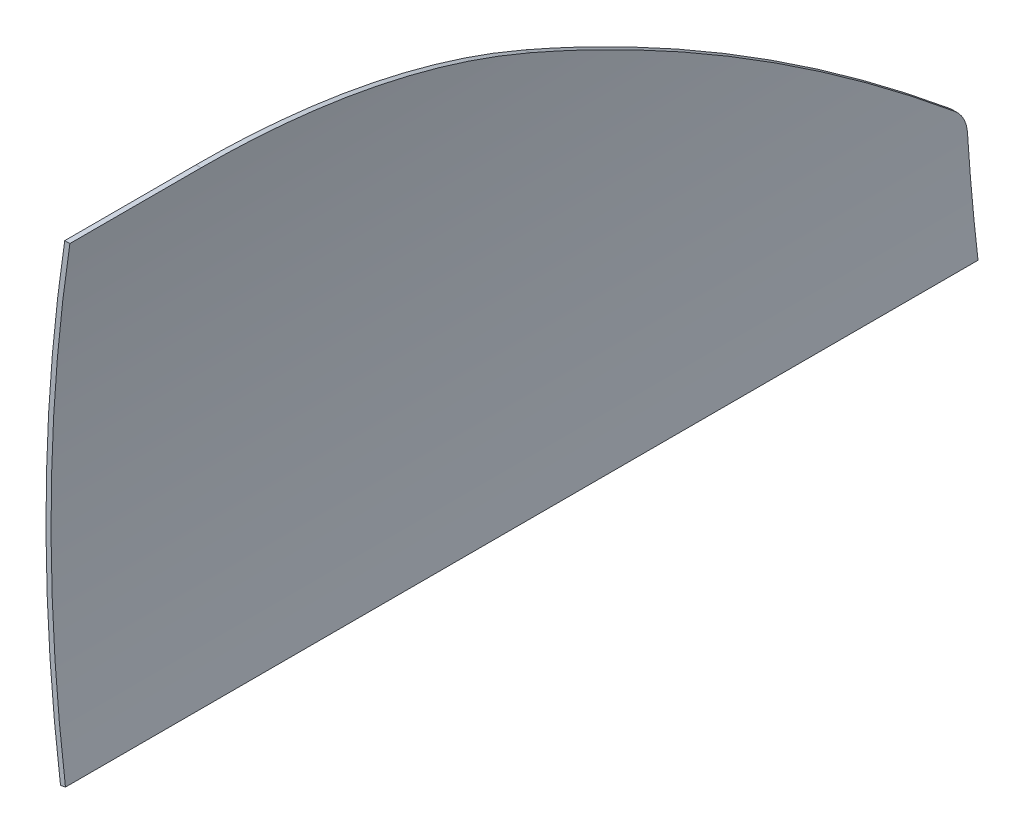
ISO-10303-21;
HEADER;
FILE_DESCRIPTION(('STEP AP214'),'2;1');
FILE_NAME('part.step','',(''),(''),'','','');
FILE_SCHEMA(('AUTOMOTIVE_DESIGN { 1 0 10303 214 1 1 1 1 }'));
ENDSEC;
DATA;
#1=APPLICATION_CONTEXT('core data for automotive mechanical design processes');
#2=APPLICATION_PROTOCOL_DEFINITION('international standard','automotive_design',2000,#1);
#3=PRODUCT_CONTEXT('',#1,'mechanical');
#4=PRODUCT('Part','Part','',(#3));
#5=PRODUCT_RELATED_PRODUCT_CATEGORY('part','',(#4));
#6=PRODUCT_DEFINITION_FORMATION('','',#4);
#7=PRODUCT_DEFINITION_CONTEXT('part definition',#1,'design');
#8=PRODUCT_DEFINITION('design','',#6,#7);
#9=PRODUCT_DEFINITION_SHAPE('','',#8);
#10=(LENGTH_UNIT() NAMED_UNIT(*) SI_UNIT(.MILLI.,.METRE.));
#11=(NAMED_UNIT(*) PLANE_ANGLE_UNIT() SI_UNIT($,.RADIAN.));
#12=(NAMED_UNIT(*) SI_UNIT($,.STERADIAN.) SOLID_ANGLE_UNIT());
#13=UNCERTAINTY_MEASURE_WITH_UNIT(LENGTH_MEASURE(1.E-05),#10,'distance_accuracy_value','');
#14=(GEOMETRIC_REPRESENTATION_CONTEXT(3) GLOBAL_UNCERTAINTY_ASSIGNED_CONTEXT((#13)) GLOBAL_UNIT_ASSIGNED_CONTEXT((#10,
#11,#12)) REPRESENTATION_CONTEXT('',''));
#15=CARTESIAN_POINT('',(0.,0.,0.));
#16=DIRECTION('',(0.,0.,1.));
#17=DIRECTION('',(1.,0.,0.));
#18=AXIS2_PLACEMENT_3D('',#15,#16,#17);
#19=CARTESIAN_POINT('',(1662.91267359414,250.,308.));
#20=DIRECTION('',(0.,0.,1.));
#21=DIRECTION('',(-1.,0.,0.));
#22=AXIS2_PLACEMENT_3D('',#19,#20,#21);
#23=CYLINDRICAL_SURFACE('',#22,1679.1);
#24=CARTESIAN_POINT('',(1662.91267359414,250.,404.));
#25=DIRECTION('',(0.,0.,1.));
#26=DIRECTION('',(1.,0.,0.));
#27=AXIS2_PLACEMENT_3D('',#24,#25,#26);
#28=CIRCLE('',#27,1679.1);
#29=CARTESIAN_POINT('',(-1.85821629717053,31.1057466023691,404.));
#30=VERTEX_POINT('',#29);
#31=CARTESIAN_POINT('',(-12.2574940213667,135.188330161751,404.));
#32=VERTEX_POINT('',#31);
#33=EDGE_CURVE('E126',#30,#32,#28,.F.);
#34=ORIENTED_EDGE('',*,*,#33,.T.);
#35=CARTESIAN_POINT('',(-12.2574940213667,135.188330161751,404.));
#36=CARTESIAN_POINT('',(-12.2864303509859,135.610524856966,403.999999538775));
#37=CARTESIAN_POINT('',(-12.3152033484983,136.032683792228,404.008913477108));
#38=CARTESIAN_POINT('',(-12.3723795026291,136.876264779503,404.044547705152));
#39=CARTESIAN_POINT('',(-12.4007826677193,137.297686848203,404.071267586249));
#40=CARTESIAN_POINT('',(-12.4853616680688,138.559685367766,404.178086712017));
#41=CARTESIAN_POINT('',(-12.5409203534523,139.398188875581,404.28484546129));
#42=CARTESIAN_POINT('',(-12.6499925060041,141.063056240984,404.568716356648));
#43=CARTESIAN_POINT('',(-12.7035066300835,141.88942394433,404.745805693771));
#44=CARTESIAN_POINT('',(-12.7820081314885,143.115428253876,405.063181768486));
#45=CARTESIAN_POINT('',(-12.8078810880648,143.521850268377,405.177601608815));
#46=CARTESIAN_POINT('',(-12.8590142278855,144.329644118176,405.423529286639));
#47=CARTESIAN_POINT('',(-12.8842742524691,144.731014633194,405.55504149375));
#48=CARTESIAN_POINT('',(-12.9591045688719,145.926800879809,405.975026753511));
#49=CARTESIAN_POINT('',(-13.0077016081075,146.712524044109,406.288853342524));
#50=CARTESIAN_POINT('',(-13.1020404921137,148.254802470497,406.981820549094));
#51=CARTESIAN_POINT('',(-13.1477823222455,149.011357583031,407.360961501482));
#52=CARTESIAN_POINT('',(-13.214080157634,150.119809342587,407.976366585649));
#53=CARTESIAN_POINT('',(-13.2357877410823,150.484795843403,408.189216356547));
#54=CARTESIAN_POINT('',(-13.278414448833,151.205381719958,408.630087692131));
#55=CARTESIAN_POINT('',(-13.2993337916973,151.560983689508,408.858105001969));
#56=CARTESIAN_POINT('',(-13.3608843173413,152.61282487253,409.56437490661));
#57=CARTESIAN_POINT('',(-13.4003237306305,153.294362851921,410.064991794749));
#58=CARTESIAN_POINT('',(-13.4615129469372,154.362325531576,410.92115984097));
#59=CARTESIAN_POINT('',(-13.4842945370347,154.762566032009,411.259638658816));
#60=CARTESIAN_POINT('',(-13.5285512291079,155.544809266365,411.957127853397));
#61=CARTESIAN_POINT('',(-13.5500264614183,155.926813818856,412.316136174958));
#62=CARTESIAN_POINT('',(-13.5916281455417,156.671145444289,413.053335841709));
#63=CARTESIAN_POINT('',(-13.6117559204717,157.033491752044,413.431507708688));
#64=CARTESIAN_POINT('',(-13.6506747354486,157.738016724901,414.206412841287));
#65=CARTESIAN_POINT('',(-13.6694654753302,158.080190858401,414.603150241946));
#66=CARTESIAN_POINT('',(-13.6875775153225,158.411747589012,415.008610293105));
#67=B_SPLINE_CURVE_WITH_KNOTS('',3,(#35,#36,#37,#38,#39,#40,#41,#42,#43,#44,#45,#46,#47,#48,#49,
#50,#51,#52,#53,#54,#55,#56,#57,#58,#59,#60,#61,#62,#63,#64,#65,#66),.UNSPECIFIED.,.F.,.F.,(4,2,
2,2,2,2,2,2,2,2,2,2,2,2,2,4),(0.,1.26936796567069,2.53870680251005,5.07680077410025,
7.61407228599208,8.88278287242378,10.1518184415712,12.691026200315,15.2302469765906,
16.4991318934745,17.7676623476523,20.3038206508079,21.8772282234228,23.4504785596796,
25.0221606911958,26.5941945601457),.UNSPECIFIED.);
#68=CARTESIAN_POINT('',(-13.6875775153225,158.411747589012,415.008610293105));
#69=VERTEX_POINT('',#68);
#70=EDGE_CURVE('E128',#32,#69,#67,.T.);
#71=ORIENTED_EDGE('',*,*,#70,.T.);
#72=CARTESIAN_POINT('',(-13.6875775153225,158.411747589012,415.008610293105));
#73=CARTESIAN_POINT('',(-14.0526604980433,165.095014728516,423.181148219991));
#74=CARTESIAN_POINT('',(-14.3741894513233,171.714468700817,431.407747595827));
#75=CARTESIAN_POINT('',(-14.9347228152785,184.82354667566,447.966416379743));
#76=CARTESIAN_POINT('',(-15.1737279246748,191.313171777012,456.298484894205));
#77=CARTESIAN_POINT('',(-15.5737914896638,204.160127369066,473.065089132358));
#78=CARTESIAN_POINT('',(-15.7348544857563,210.51746554546,481.499618857843));
#79=CARTESIAN_POINT('',(-15.9835965028871,223.098173918881,498.468951186167));
#80=CARTESIAN_POINT('',(-16.0712753699186,229.32154383473,507.003753999405));
#81=CARTESIAN_POINT('',(-16.2305403339362,247.734216196206,532.680007252465));
#82=CARTESIAN_POINT('',(-16.2000296183187,259.722524737031,549.966977710933));
#83=CARTESIAN_POINT('',(-15.9009872164411,283.146739309586,584.908826626485));
#84=CARTESIAN_POINT('',(-15.6324524413265,294.582638170626,602.563709855094));
#85=CARTESIAN_POINT('',(-14.8915988909184,316.889129816982,638.2208505364));
#86=CARTESIAN_POINT('',(-14.4192959396728,327.759766425494,656.223080911441));
#87=CARTESIAN_POINT('',(-13.3041349428485,348.925923713831,692.557742767511));
#88=CARTESIAN_POINT('',(-12.6612763550171,359.221442565041,710.890175298189));
#89=CARTESIAN_POINT('',(-11.5916576630007,374.247366502559,738.662078362301));
#90=CARTESIAN_POINT('',(-11.2166229949857,379.196852325935,747.985692768009));
#91=CARTESIAN_POINT('',(-10.4355944865959,388.947127714602,766.709190839875));
#92=CARTESIAN_POINT('',(-10.02960061899,393.747917149098,776.109074573111));
#93=CARTESIAN_POINT('',(-9.19056339639171,403.199499034462,794.982465920167));
#94=CARTESIAN_POINT('',(-8.7575206256569,407.850294721913,804.455971939874));
#95=CARTESIAN_POINT('',(-7.86816742590297,417.000928185204,823.474496926653));
#96=CARTESIAN_POINT('',(-7.41185706230229,421.500766385411,833.019515692597));
#97=CARTESIAN_POINT('',(-6.94580652841649,425.92460419963,842.599161720348));
#98=B_SPLINE_CURVE_WITH_KNOTS('',3,(#72,#73,#74,#75,#76,#77,#78,#79,#80,#81,#82,#83,#84,#85,#86,
#87,#88,#89,#90,#91,#92,#93,#94,#95,#96,#97),.UNSPECIFIED.,.F.,.F.,(4,2,2,2,2,2,2,2,2,2,2,2,4),
(0.,31.6903050230312,63.3803417208027,95.0685321004801,126.756788982061,189.854971713458,
252.953973286261,316.048075654652,379.142378622431,410.828963890059,442.515577028968,
474.201505972227,505.887345833241),.UNSPECIFIED.);
#99=CARTESIAN_POINT('',(-6.9458065284167,425.92460419963,842.599161720348));
#100=VERTEX_POINT('',#99);
#101=EDGE_CURVE('E182',#69,#100,#98,.T.);
#102=ORIENTED_EDGE('',*,*,#101,.T.);
#103=CARTESIAN_POINT('',(-6.9458065284167,425.92460419963,842.599161720348));
#104=CARTESIAN_POINT('',(-6.69665422505623,428.289455799148,847.720129327968));
#105=CARTESIAN_POINT('',(-6.44814509912682,430.600140181221,852.866129653417));
#106=CARTESIAN_POINT('',(-5.95383995624069,435.112203418949,863.205961136838));
#107=CARTESIAN_POINT('',(-5.70804394052839,437.313582224469,868.399792316747));
#108=CARTESIAN_POINT('',(-5.22058710120033,441.606104214611,878.833151128363));
#109=CARTESIAN_POINT('',(-4.97892636085668,443.697245181133,884.072679677079));
#110=CARTESIAN_POINT('',(-4.5011069586019,447.768281725359,894.594921707438));
#111=CARTESIAN_POINT('',(-4.26494829526287,449.748177331933,899.877635177873));
#112=CARTESIAN_POINT('',(-3.56643098544166,455.521918043394,915.793379311696));
#113=CARTESIAN_POINT('',(-3.11429256666275,459.147536755344,926.488471315989));
#114=CARTESIAN_POINT('',(-2.2471219840007,465.943039964759,948.023356894242));
#115=CARTESIAN_POINT('',(-1.83208912227906,469.112933033668,958.863147742464));
#116=CARTESIAN_POINT('',(-1.0548726973034,474.938422892343,980.47225093206));
#117=CARTESIAN_POINT('',(-0.691871298106507,477.602260730111,991.239311186875));
#118=CARTESIAN_POINT('',(-0.0171953739844431,482.480376850164,1012.87680353208));
#119=CARTESIAN_POINT('',(0.294477429150203,484.694640052288,1023.74723907721));
#120=CARTESIAN_POINT('',(0.860236924533955,488.668247349398,1045.5654994134));
#121=CARTESIAN_POINT('',(1.11435833954759,490.427865838209,1056.51327340947));
#122=CARTESIAN_POINT('',(1.56034320955563,493.490542973513,1078.47282909993));
#123=CARTESIAN_POINT('',(1.75221486004451,494.793661722294,1089.48460217404));
#124=CARTESIAN_POINT('',(1.95738850827555,496.179701213508,1103.72808111964));
#125=CARTESIAN_POINT('',(2.00083869214886,496.472639202832,1106.93982012485));
#126=CARTESIAN_POINT('',(2.08210450724497,497.019652066328,1113.36658008729));
#127=CARTESIAN_POINT('',(2.11992035367996,497.273728424889,1116.58160091444));
#128=CARTESIAN_POINT('',(2.22481135626323,497.977538930866,1126.23002553376));
#129=CARTESIAN_POINT('',(2.28334550971719,498.368959189604,1132.66786725262));
#130=CARTESIAN_POINT('',(2.37749551935759,498.997669252438,1145.58555103175));
#131=CARTESIAN_POINT('',(2.41298766087125,499.234127112253,1152.06543417793));
#132=CARTESIAN_POINT('',(2.46036435475487,499.549479026968,1165.03020086237));
#133=CARTESIAN_POINT('',(2.47224496859776,499.628346795023,1171.5150850544));
#134=CARTESIAN_POINT('',(2.4722179376695,499.628330161751,1178.));
#135=B_SPLINE_CURVE_WITH_KNOTS('',3,(#103,#104,#105,#106,#107,#108,#109,#110,#111,#112,#113,
#114,#115,#116,#117,#118,#119,#120,#121,#122,#123,#124,#125,#126,#127,#128,#129,#130,#131,#132,
#133,#134),.UNSPECIFIED.,.F.,.F.,(4,2,2,2,2,2,2,2,2,2,2,2,2,2,2,4),(0.,16.9380846326701,
33.8761770340211,50.8146101176378,67.7530388053932,101.647878235621,135.542080076646,
168.82527471867,202.109585600496,235.373761075662,268.63355537605,278.309500796286,
287.98507653412,307.332985956469,326.783935297483,346.238128886989),.UNSPECIFIED.);
#136=CARTESIAN_POINT('',(2.4722179376695,499.628330161751,1178.));
#137=VERTEX_POINT('',#136);
#138=EDGE_CURVE('E175',#100,#137,#135,.T.);
#139=ORIENTED_EDGE('',*,*,#138,.T.);
#140=DIRECTION('',(0.,0.,-1.));
#141=VECTOR('',#140,1.);
#142=CARTESIAN_POINT('',(2.4722179376695,499.628330161751,308.));
#143=LINE('',#142,#141);
#144=CARTESIAN_POINT('',(2.4722179376695,499.628330161751,1308.));
#145=VERTEX_POINT('',#144);
#146=EDGE_CURVE('E125',#145,#137,#143,.T.);
#147=ORIENTED_EDGE('',*,*,#146,.F.);
#148=CARTESIAN_POINT('',(1662.91267359414,250.,1308.));
#149=DIRECTION('',(0.,0.,1.));
#150=DIRECTION('',(1.,0.,0.));
#151=AXIS2_PLACEMENT_3D('',#148,#149,#150);
#152=CIRCLE('',#151,1679.1);
#153=CARTESIAN_POINT('',(-1.85821629717053,31.1057466023691,1308.));
#154=VERTEX_POINT('',#153);
#155=EDGE_CURVE('E108',#154,#145,#152,.F.);
#156=ORIENTED_EDGE('',*,*,#155,.F.);
#157=DIRECTION('',(0.,0.,-1.));
#158=VECTOR('',#157,1.);
#159=CARTESIAN_POINT('',(-1.85821629717053,31.1057466023691,1308.));
#160=LINE('',#159,#158);
#161=EDGE_CURVE('E115',#154,#30,#160,.T.);
#162=ORIENTED_EDGE('',*,*,#161,.T.);
#163=EDGE_LOOP('',(#34,#71,#102,#139,#147,#156,#162));
#164=FACE_BOUND('',#163,.T.);
#165=ADVANCED_FACE('F43',(#164),#23,.F.);
#166=CARTESIAN_POINT('',(1662.91267359414,250.,308.));
#167=DIRECTION('',(0.,0.,1.));
#168=DIRECTION('',(-1.,0.,0.));
#169=AXIS2_PLACEMENT_3D('',#166,#167,#168);
#170=CYLINDRICAL_SURFACE('',#169,1684.1);
#171=CARTESIAN_POINT('',(1662.91267359414,250.,1308.));
#172=DIRECTION('',(0.,0.,1.));
#173=DIRECTION('',(1.,0.,0.));
#174=AXIS2_PLACEMENT_3D('',#171,#172,#173);
#175=CIRCLE('',#174,1684.1);
#176=CARTESIAN_POINT('',(-6.7806035687441,30.1883301617507,1308.));
#177=VERTEX_POINT('',#176);
#178=CARTESIAN_POINT('',(-2.58380096852528,499.628330161751,1308.));
#179=VERTEX_POINT('',#178);
#180=EDGE_CURVE('E111',#177,#179,#175,.F.);
#181=ORIENTED_EDGE('',*,*,#180,.T.);
#182=DIRECTION('',(0.,0.,1.));
#183=VECTOR('',#182,1.);
#184=CARTESIAN_POINT('',(-2.58380096852528,499.628330161751,308.));
#185=LINE('',#184,#183);
#186=CARTESIAN_POINT('',(-2.58380096852528,499.628330161751,1178.));
#187=VERTEX_POINT('',#186);
#188=EDGE_CURVE('E210',#187,#179,#185,.T.);
#189=ORIENTED_EDGE('',*,*,#188,.F.);
#190=CARTESIAN_POINT('',(-11.9733952586685,425.92460419963,842.599161720348));
#191=CARTESIAN_POINT('',(-11.7249826032305,428.289534261498,847.720299219285));
#192=CARTESIAN_POINT('',(-11.477211584378,430.600293434025,852.866470957045));
#193=CARTESIAN_POINT('',(-10.9843754167438,435.112498708392,863.206647711423));
#194=CARTESIAN_POINT('',(-10.7393102691941,437.313944760463,868.400652749819));
#195=CARTESIAN_POINT('',(-10.2533037923008,441.606593427659,878.834360951981));
#196=CARTESIAN_POINT('',(-10.01236254583,443.69779382907,884.074065030918));
#197=CARTESIAN_POINT('',(-9.53596673581243,447.768941388827,894.596659439372));
#198=CARTESIAN_POINT('',(-9.30051217084658,449.74888857595,899.879549757718));
#199=CARTESIAN_POINT('',(-8.6040792272163,455.522770683743,915.795821771126));
#200=CARTESIAN_POINT('',(-8.1532921810595,459.148467444129,926.491265955587));
#201=CARTESIAN_POINT('',(-7.2887179889605,465.944095008922,948.026855078916));
#202=CARTESIAN_POINT('',(-6.87493014761872,469.114034379964,958.866997293784));
#203=CARTESIAN_POINT('',(-6.10004964455078,474.939587826747,980.476803767954));
#204=CARTESIAN_POINT('',(-5.73814155831986,477.603443058794,991.24421613666));
#205=CARTESIAN_POINT('',(-5.06550272324403,482.481563524898,1012.88240676481));
#206=CARTESIAN_POINT('',(-4.75477369104536,484.695813678895,1023.75318847854));
#207=CARTESIAN_POINT('',(-4.19073286068251,488.669365699768,1045.57213479535));
#208=CARTESIAN_POINT('',(-3.93738644800712,490.428941927094,1056.52024861739));
#209=CARTESIAN_POINT('',(-3.49276810966322,493.491506162567,1078.48047593508));
#210=CARTESIAN_POINT('',(-3.30148801279038,494.794554275722,1089.49258081167));
#211=CARTESIAN_POINT('',(-3.09695841018485,496.180442680612,1103.73604857412));
#212=CARTESIAN_POINT('',(-3.05364919660776,496.473317983097,1106.94744777212));
#213=CARTESIAN_POINT('',(-2.97264709858215,497.020213703438,1113.37352663182));
#214=CARTESIAN_POINT('',(-2.9349539996391,497.27423560522,1116.58820616351));
#215=CARTESIAN_POINT('',(-2.83040353097442,497.977895146691,1126.2356049378));
#216=CARTESIAN_POINT('',(-2.77205950474492,498.369231288201,1132.67276010737));
#217=CARTESIAN_POINT('',(-2.67821542833253,498.99780573721,1145.58905721958));
#218=CARTESIAN_POINT('',(-2.6428386682791,499.234212433979,1152.06824022177));
#219=CARTESIAN_POINT('',(-2.59561600897564,499.549496096687,1165.0316048023));
#220=CARTESIAN_POINT('',(-2.58377403579578,499.628346779162,1171.51578703415));
#221=CARTESIAN_POINT('',(-2.58380096852547,499.628330161751,1178.));
#222=B_SPLINE_CURVE_WITH_KNOTS('',3,(#190,#191,#192,#193,#194,#195,#196,#197,#198,#199,#200,
#201,#202,#203,#204,#205,#206,#207,#208,#209,#210,#211,#212,#213,#214,#215,#216,#217,#218,#219,
#220,#221),.UNSPECIFIED.,.F.,.F.,(4,2,2,2,2,2,2,2,2,2,2,2,2,2,2,4),(0.,16.9385476788605,
33.8771030698093,50.8159984547609,67.7548894582471,101.650641035824,135.545755409212,
168.82988000149,202.1151207816,235.380229348293,268.640956691687,278.315864314328,
287.990402331422,307.336236441075,326.785080171984,346.237168084292),.UNSPECIFIED.);
#223=CARTESIAN_POINT('',(-11.9733952586685,425.92460419963,842.599161720348));
#224=VERTEX_POINT('',#223);
#225=EDGE_CURVE('E158',#224,#187,#222,.T.);
#226=ORIENTED_EDGE('',*,*,#225,.F.);
#227=CARTESIAN_POINT('',(-18.6950101479129,158.411747589012,415.008610293105));
#228=CARTESIAN_POINT('',(-19.0590059421974,165.095013310755,423.181146564479));
#229=CARTESIAN_POINT('',(-19.3795777885102,171.714460443679,431.4077374467));
#230=CARTESIAN_POINT('',(-19.9384431717419,184.823517383443,447.966379098624));
#231=CARTESIAN_POINT('',(-20.1767374010784,191.313128282503,456.298428980213));
#232=CARTESIAN_POINT('',(-20.5756115570721,204.160053083756,473.064991331561));
#233=CARTESIAN_POINT('',(-20.7361959844722,210.517374627379,481.499497838297));
#234=CARTESIAN_POINT('',(-20.9841993254012,223.09804747527,498.468779020019));
#235=CARTESIAN_POINT('',(-21.0716180863699,229.321398500165,507.00355390404));
#236=CARTESIAN_POINT('',(-21.2304117043605,247.734041780501,532.679758911311));
#237=CARTESIAN_POINT('',(-21.199992881682,259.722338347722,549.966706244056));
#238=CARTESIAN_POINT('',(-20.9018413949271,283.146535568569,584.908516136387));
#239=CARTESIAN_POINT('',(-20.6341056706867,294.582429097039,602.563383437377));
#240=CARTESIAN_POINT('',(-19.8954566431234,316.888927216849,638.220518890473));
#241=CARTESIAN_POINT('',(-19.4245590235788,327.759575371669,656.222760123399));
#242=CARTESIAN_POINT('',(-18.3127183665835,348.925767934324,692.557468168108));
#243=CARTESIAN_POINT('',(-17.6717747907739,359.221310521274,710.889936025203));
#244=CARTESIAN_POINT('',(-16.6053464220672,374.247266325701,738.661890808553));
#245=CARTESIAN_POINT('',(-16.231431467058,379.196756675552,747.985511309847));
#246=CARTESIAN_POINT('',(-15.4527361752717,388.947043965024,766.709027795632));
#247=CARTESIAN_POINT('',(-15.0479558114802,393.7478407745,776.108923846876));
#248=CARTESIAN_POINT('',(-14.2114279958425,403.199440475927,794.98234720523));
#249=CARTESIAN_POINT('',(-13.7796811228182,407.850246584103,804.455872928099));
#250=CARTESIAN_POINT('',(-12.8929911857361,417.000902821171,823.474443173376));
#251=CARTESIAN_POINT('',(-12.4380481865187,421.500753371973,833.019487495804));
#252=CARTESIAN_POINT('',(-11.9733952586683,425.92460419963,842.599161720348));
#253=B_SPLINE_CURVE_WITH_KNOTS('',3,(#227,#228,#229,#230,#231,#232,#233,#234,#235,#236,#237,
#238,#239,#240,#241,#242,#243,#244,#245,#246,#247,#248,#249,#250,#251,#252),.UNSPECIFIED.,.F.,
.F.,(4,2,2,2,2,2,2,2,2,2,2,2,4),(0.,31.6901868330339,63.3801069668416,95.0681914859438,
126.75634207878,189.854457238723,252.953386050714,316.047444596156,379.141702897296,
410.828191784113,442.514708404305,474.200545123689,505.886293276134),.UNSPECIFIED.);
#254=CARTESIAN_POINT('',(-18.6950101479129,158.411747589012,415.008610293105));
#255=VERTEX_POINT('',#254);
#256=EDGE_CURVE('E140',#255,#224,#253,.T.);
#257=ORIENTED_EDGE('',*,*,#256,.F.);
#258=CARTESIAN_POINT('',(-17.2691887258185,135.188330161751,404.));
#259=CARTESIAN_POINT('',(-17.2980386030764,135.610522804638,403.999999538457));
#260=CARTESIAN_POINT('',(-17.326725636894,136.03267962108,404.008913390481));
#261=CARTESIAN_POINT('',(-17.3837309692695,136.876256231334,404.044547254486));
#262=CARTESIAN_POINT('',(-17.4120492762759,137.29767604184,404.071266857762));
#263=CARTESIAN_POINT('',(-17.4963755833222,138.559667528155,404.178084829926));
#264=CARTESIAN_POINT('',(-17.5517682778365,139.398166049207,404.284842383296));
#265=CARTESIAN_POINT('',(-17.6605145245861,141.063022378518,404.568709769109));
#266=CARTESIAN_POINT('',(-17.7138687330068,141.889384039979,404.745796749863));
#267=CARTESIAN_POINT('',(-17.7921356511594,143.115378964162,405.063168315446));
#268=CARTESIAN_POINT('',(-17.8179312930374,143.521797799806,405.177586491451));
#269=CARTESIAN_POINT('',(-17.8689116354754,144.329585197265,405.423510492081));
#270=CARTESIAN_POINT('',(-17.8940961778524,144.730952438805,405.555020686145));
#271=CARTESIAN_POINT('',(-17.9687028733519,145.926728516122,405.974999265501));
#272=CARTESIAN_POINT('',(-18.0171546853825,146.712444682599,406.288820610381));
#273=CARTESIAN_POINT('',(-18.1112116625723,148.254709070757,406.981775657472));
#274=CARTESIAN_POINT('',(-18.156816813109,149.011257142603,407.360909695137));
#275=CARTESIAN_POINT('',(-18.2229165717523,150.119698636821,407.97630314448));
#276=CARTESIAN_POINT('',(-18.244559307479,150.484681820997,408.189148864867));
#277=CARTESIAN_POINT('',(-18.2870586826039,151.205261155659,408.630011659053));
#278=CARTESIAN_POINT('',(-18.3079155399106,151.560859899949,408.858024478095));
#279=CARTESIAN_POINT('',(-18.3692822301282,152.612691620429,409.564280249447));
#280=CARTESIAN_POINT('',(-18.4086038662512,153.294223547496,410.06488681713));
#281=CARTESIAN_POINT('',(-18.4696114301195,154.362195266067,410.921051249413));
#282=CARTESIAN_POINT('',(-18.4923259913739,154.762449818049,411.259538260747));
#283=CARTESIAN_POINT('',(-18.5364524316386,155.544719903156,411.957044950601));
#284=CARTESIAN_POINT('',(-18.5578644405954,155.926737254858,412.316062573969));
#285=CARTESIAN_POINT('',(-18.5993436052094,156.671093090346,413.053281762681));
#286=CARTESIAN_POINT('',(-18.6194120803726,157.033450813814,413.431463845211));
#287=CARTESIAN_POINT('',(-18.658216192609,157.737997273491,414.206390281407));
#288=CARTESIAN_POINT('',(-18.6769515304191,158.080181478202,414.60313876994));
#289=CARTESIAN_POINT('',(-18.695010147913,158.411747589012,415.008610293105));
#290=B_SPLINE_CURVE_WITH_KNOTS('',3,(#258,#259,#260,#261,#262,#263,#264,#265,#266,#267,#268,
#269,#270,#271,#272,#273,#274,#275,#276,#277,#278,#279,#280,#281,#282,#283,#284,#285,#286,#287,
#288,#289),.UNSPECIFIED.,.F.,.F.,(4,2,2,2,2,2,2,2,2,2,2,2,2,2,2,4),(0.,1.2693441151616,
2.53865909538991,5.07670522118874,7.61392734975939,8.88261326498726,10.1516241498798,
12.6907817628197,15.2299524175547,16.4988126838984,17.7673184917156,20.3034276082294,
21.8768744158895,23.4501639934886,25.02188503638,26.5939577940011),.UNSPECIFIED.);
#291=CARTESIAN_POINT('',(-17.2691887258185,135.188330161751,404.));
#292=VERTEX_POINT('',#291);
#293=EDGE_CURVE('E52',#292,#255,#290,.T.);
#294=ORIENTED_EDGE('',*,*,#293,.F.);
#295=CARTESIAN_POINT('',(1662.91267359414,250.,404.));
#296=DIRECTION('',(0.,0.,1.));
#297=DIRECTION('',(1.,0.,0.));
#298=AXIS2_PLACEMENT_3D('',#295,#296,#297);
#299=CIRCLE('',#298,1684.1);
#300=CARTESIAN_POINT('',(-6.7806035687441,30.1883301617507,404.));
#301=VERTEX_POINT('',#300);
#302=EDGE_CURVE('E11',#301,#292,#299,.F.);
#303=ORIENTED_EDGE('',*,*,#302,.F.);
#304=DIRECTION('',(0.,0.,1.));
#305=VECTOR('',#304,1.);
#306=CARTESIAN_POINT('',(-6.7806035687441,30.1883301617507,308.));
#307=LINE('',#306,#305);
#308=EDGE_CURVE('E183',#177,#301,#307,.F.);
#309=ORIENTED_EDGE('',*,*,#308,.F.);
#310=EDGE_LOOP('',(#181,#189,#226,#257,#294,#303,#309));
#311=FACE_BOUND('',#310,.T.);
#312=ADVANCED_FACE('F150',(#311),#170,.T.);
#313=CARTESIAN_POINT('',(1662.91267359414,250.,1308.));
#314=DIRECTION('',(0.,0.,-1.));
#315=DIRECTION('',(1.,0.,0.));
#316=AXIS2_PLACEMENT_3D('',#313,#314,#315);
#317=PLANE('',#316);
#318=ORIENTED_EDGE('',*,*,#155,.T.);
#319=DIRECTION('',(-1.,0.,0.));
#320=VECTOR('',#319,1.);
#321=CARTESIAN_POINT('',(1662.91267359414,499.628330161751,1308.));
#322=LINE('',#321,#320);
#323=EDGE_CURVE('E60',#145,#179,#322,.T.);
#324=ORIENTED_EDGE('',*,*,#323,.T.);
#325=ORIENTED_EDGE('',*,*,#180,.F.);
#326=DIRECTION('',(-0.983071696061995,-0.183221288069353,0.));
#327=VECTOR('',#326,1.);
#328=CARTESIAN_POINT('',(-6.7806035687441,30.1883301617507,1308.));
#329=LINE('',#328,#327);
#330=EDGE_CURVE('E104',#154,#177,#329,.T.);
#331=ORIENTED_EDGE('',*,*,#330,.F.);
#332=EDGE_LOOP('',(#318,#324,#325,#331));
#333=FACE_BOUND('',#332,.T.);
#334=ADVANCED_FACE('F106',(#333),#317,.F.);
#335=CARTESIAN_POINT('',(-40.,30.1883301617507,404.));
#336=DIRECTION('',(0.,0.,-1.));
#337=DIRECTION('',(1.,0.,0.));
#338=AXIS2_PLACEMENT_3D('',#335,#336,#337);
#339=PLANE('',#338);
#340=DIRECTION('',(-0.983071696061995,-0.183221288069353,0.));
#341=VECTOR('',#340,1.);
#342=CARTESIAN_POINT('',(-6.7806035687441,30.1883301617507,404.));
#343=LINE('',#342,#341);
#344=EDGE_CURVE('E116',#30,#301,#343,.T.);
#345=ORIENTED_EDGE('',*,*,#344,.T.);
#346=ORIENTED_EDGE('',*,*,#302,.T.);
#347=DIRECTION('',(1.,0.,0.));
#348=VECTOR('',#347,1.);
#349=CARTESIAN_POINT('',(-40.,135.188330161751,404.));
#350=LINE('',#349,#348);
#351=EDGE_CURVE('E67',#292,#32,#350,.T.);
#352=ORIENTED_EDGE('',*,*,#351,.T.);
#353=ORIENTED_EDGE('',*,*,#33,.F.);
#354=EDGE_LOOP('',(#345,#346,#352,#353));
#355=FACE_BOUND('',#354,.T.);
#356=ADVANCED_FACE('F220',(#355),#339,.T.);
#357=CARTESIAN_POINT('',(-40.,135.188330161751,434.));
#358=DIRECTION('',(1.,0.,0.));
#359=DIRECTION('',(0.,0.,1.));
#360=AXIS2_PLACEMENT_3D('',#357,#358,#359);
#361=CYLINDRICAL_SURFACE('',#360,29.9999999999999);
#362=ORIENTED_EDGE('',*,*,#70,.F.);
#363=ORIENTED_EDGE('',*,*,#351,.F.);
#364=ORIENTED_EDGE('',*,*,#293,.T.);
#365=DIRECTION('',(1.,0.,0.));
#366=VECTOR('',#365,1.);
#367=CARTESIAN_POINT('',(-40.,158.411747589012,415.008610293105));
#368=LINE('',#367,#366);
#369=EDGE_CURVE('E198',#255,#69,#368,.T.);
#370=ORIENTED_EDGE('',*,*,#369,.T.);
#371=EDGE_LOOP('',(#362,#363,#364,#370));
#372=FACE_BOUND('',#371,.T.);
#373=ADVANCED_FACE('F147',(#372),#361,.T.);
#374=CARTESIAN_POINT('',(-40.,-1389.81608089507,1681.10125741948));
#375=DIRECTION('',(1.,0.,0.));
#376=DIRECTION('',(0.,0.,1.));
#377=AXIS2_PLACEMENT_3D('',#374,#375,#376);
#378=CYLINDRICAL_SURFACE('',#377,2000.);
#379=ORIENTED_EDGE('',*,*,#101,.F.);
#380=ORIENTED_EDGE('',*,*,#369,.F.);
#381=ORIENTED_EDGE('',*,*,#256,.T.);
#382=DIRECTION('',(1.,0.,0.));
#383=VECTOR('',#382,1.);
#384=CARTESIAN_POINT('',(-40.,425.92460419963,842.599161720348));
#385=LINE('',#384,#383);
#386=EDGE_CURVE('E203',#224,#100,#385,.T.);
#387=ORIENTED_EDGE('',*,*,#386,.T.);
#388=EDGE_LOOP('',(#379,#380,#381,#387));
#389=FACE_BOUND('',#388,.T.);
#390=ADVANCED_FACE('F170',(#389),#378,.T.);
#391=CARTESIAN_POINT('',(-40.,-300.371669838249,1178.));
#392=DIRECTION('',(1.,0.,0.));
#393=DIRECTION('',(0.,0.,1.));
#394=AXIS2_PLACEMENT_3D('',#391,#392,#393);
#395=CYLINDRICAL_SURFACE('',#394,800.);
#396=ORIENTED_EDGE('',*,*,#138,.F.);
#397=ORIENTED_EDGE('',*,*,#386,.F.);
#398=ORIENTED_EDGE('',*,*,#225,.T.);
#399=DIRECTION('',(1.,0.,0.));
#400=VECTOR('',#399,1.);
#401=CARTESIAN_POINT('',(-40.,499.628330161751,1178.));
#402=LINE('',#401,#400);
#403=EDGE_CURVE('E122',#187,#137,#402,.T.);
#404=ORIENTED_EDGE('',*,*,#403,.T.);
#405=EDGE_LOOP('',(#396,#397,#398,#404));
#406=FACE_BOUND('',#405,.T.);
#407=ADVANCED_FACE('F166',(#406),#395,.T.);
#408=CARTESIAN_POINT('',(-40.,499.628330161751,1308.));
#409=DIRECTION('',(0.,1.,0.));
#410=DIRECTION('',(0.,0.,-1.));
#411=AXIS2_PLACEMENT_3D('',#408,#409,#410);
#412=PLANE('',#411);
#413=ORIENTED_EDGE('',*,*,#323,.F.);
#414=ORIENTED_EDGE('',*,*,#146,.T.);
#415=ORIENTED_EDGE('',*,*,#403,.F.);
#416=ORIENTED_EDGE('',*,*,#188,.T.);
#417=EDGE_LOOP('',(#413,#414,#415,#416));
#418=FACE_BOUND('',#417,.T.);
#419=ADVANCED_FACE('F169',(#418),#412,.T.);
#420=CARTESIAN_POINT('',(-6.7806035687441,30.1883301617507,1308.));
#421=DIRECTION('',(-0.183221288069353,0.983071696061995,0.));
#422=DIRECTION('',(-0.983071696061995,-0.183221288069353,0.));
#423=AXIS2_PLACEMENT_3D('',#420,#421,#422);
#424=PLANE('',#423);
#425=ORIENTED_EDGE('',*,*,#344,.F.);
#426=ORIENTED_EDGE('',*,*,#161,.F.);
#427=ORIENTED_EDGE('',*,*,#330,.T.);
#428=ORIENTED_EDGE('',*,*,#308,.T.);
#429=EDGE_LOOP('',(#425,#426,#427,#428));
#430=FACE_BOUND('',#429,.T.);
#431=ADVANCED_FACE('F119',(#430),#424,.F.);
#432=CLOSED_SHELL('',(#165,#312,#334,#356,#373,#390,#407,#419,#431));
#433=MANIFOLD_SOLID_BREP('B2',#432);
#434=ADVANCED_BREP_SHAPE_REPRESENTATION('',(#18,#433),#14);
#435=SHAPE_DEFINITION_REPRESENTATION(#9,#434);
ENDSEC;
END-ISO-10303-21;
